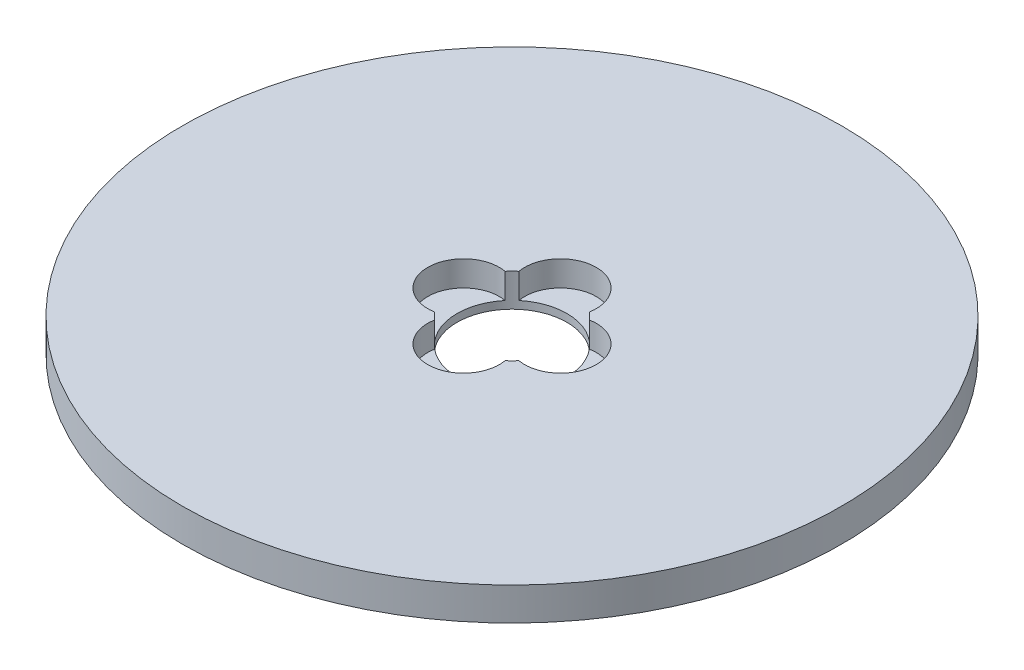
ISO-10303-21;
HEADER;
FILE_DESCRIPTION(('STEP AP214'),'2;1');
FILE_NAME('part.step','',(''),(''),'','','');
FILE_SCHEMA(('AUTOMOTIVE_DESIGN { 1 0 10303 214 1 1 1 1 }'));
ENDSEC;
DATA;
#1=APPLICATION_CONTEXT('core data for automotive mechanical design processes');
#2=APPLICATION_PROTOCOL_DEFINITION('international standard','automotive_design',2000,#1);
#3=PRODUCT_CONTEXT('',#1,'mechanical');
#4=PRODUCT('Part','Part','',(#3));
#5=PRODUCT_RELATED_PRODUCT_CATEGORY('part','',(#4));
#6=PRODUCT_DEFINITION_FORMATION('','',#4);
#7=PRODUCT_DEFINITION_CONTEXT('part definition',#1,'design');
#8=PRODUCT_DEFINITION('design','',#6,#7);
#9=PRODUCT_DEFINITION_SHAPE('','',#8);
#10=(LENGTH_UNIT() NAMED_UNIT(*) SI_UNIT(.MILLI.,.METRE.));
#11=(NAMED_UNIT(*) PLANE_ANGLE_UNIT() SI_UNIT($,.RADIAN.));
#12=(NAMED_UNIT(*) SI_UNIT($,.STERADIAN.) SOLID_ANGLE_UNIT());
#13=UNCERTAINTY_MEASURE_WITH_UNIT(LENGTH_MEASURE(1.E-05),#10,'distance_accuracy_value','');
#14=(GEOMETRIC_REPRESENTATION_CONTEXT(3) GLOBAL_UNCERTAINTY_ASSIGNED_CONTEXT((#13)) GLOBAL_UNIT_ASSIGNED_CONTEXT((#10,
#11,#12)) REPRESENTATION_CONTEXT('',''));
#15=CARTESIAN_POINT('',(0.,0.,0.));
#16=DIRECTION('',(0.,0.,1.));
#17=DIRECTION('',(1.,0.,0.));
#18=AXIS2_PLACEMENT_3D('',#15,#16,#17);
#19=CARTESIAN_POINT('',(0.,9.,0.));
#20=DIRECTION('',(0.,-1.,0.));
#21=DIRECTION('',(0.,0.,-1.));
#22=AXIS2_PLACEMENT_3D('',#19,#20,#21);
#23=CYLINDRICAL_SURFACE('',#22,90.);
#24=CARTESIAN_POINT('',(0.,9.,0.));
#25=DIRECTION('',(0.,1.,0.));
#26=DIRECTION('',(0.,0.,1.));
#27=AXIS2_PLACEMENT_3D('',#24,#25,#26);
#28=CIRCLE('',#27,90.);
#29=CARTESIAN_POINT('',(0.,9.,90.));
#30=VERTEX_POINT('',#29);
#31=EDGE_CURVE('E162',#30,#30,#28,.T.);
#32=ORIENTED_EDGE('',*,*,#31,.F.);
#33=EDGE_LOOP('',(#32));
#34=FACE_BOUND('',#33,.T.);
#35=CARTESIAN_POINT('',(0.,0.,0.));
#36=DIRECTION('',(0.,1.,0.));
#37=DIRECTION('',(0.,0.,1.));
#38=AXIS2_PLACEMENT_3D('',#35,#36,#37);
#39=CIRCLE('',#38,90.);
#40=CARTESIAN_POINT('',(0.,0.,90.));
#41=VERTEX_POINT('',#40);
#42=EDGE_CURVE('E158',#41,#41,#39,.T.);
#43=ORIENTED_EDGE('',*,*,#42,.T.);
#44=EDGE_LOOP('',(#43));
#45=FACE_BOUND('',#44,.T.);
#46=ADVANCED_FACE('F39',(#34,#45),#23,.T.);
#47=CARTESIAN_POINT('',(0.,9.,0.));
#48=DIRECTION('',(0.,1.,0.));
#49=DIRECTION('',(0.,0.,1.));
#50=AXIS2_PLACEMENT_3D('',#47,#48,#49);
#51=PLANE('',#50);
#52=CARTESIAN_POINT('',(0.,9.,13.2310116069244));
#53=DIRECTION('',(0.,1.,0.));
#54=DIRECTION('',(1.,0.,0.));
#55=AXIS2_PLACEMENT_3D('',#52,#53,#54);
#56=CIRCLE('',#55,9.7809804124525);
#57=CARTESIAN_POINT('',(-9.62712211526905,9.,11.5029787349928));
#58=VERTEX_POINT('',#57);
#59=CARTESIAN_POINT('',(9.62712211526913,9.,11.5029787349928));
#60=VERTEX_POINT('',#59);
#61=EDGE_CURVE('E141',#58,#60,#56,.T.);
#62=ORIENTED_EDGE('',*,*,#61,.F.);
#63=CARTESIAN_POINT('',(0.,9.,0.));
#64=DIRECTION('',(0.,1.,0.));
#65=DIRECTION('',(0.,0.,1.));
#66=AXIS2_PLACEMENT_3D('',#63,#64,#65);
#67=CIRCLE('',#66,15.);
#68=CARTESIAN_POINT('',(-11.5029787349928,9.,9.62712211526909));
#69=VERTEX_POINT('',#68);
#70=EDGE_CURVE('E154',#69,#58,#67,.T.);
#71=ORIENTED_EDGE('',*,*,#70,.F.);
#72=CARTESIAN_POINT('',(-13.2310116069244,9.,0.));
#73=DIRECTION('',(0.,1.,0.));
#74=DIRECTION('',(0.,0.,1.));
#75=AXIS2_PLACEMENT_3D('',#72,#73,#74);
#76=CIRCLE('',#75,9.7809804124525);
#77=CARTESIAN_POINT('',(-11.5029787349928,9.,-9.62712211526909));
#78=VERTEX_POINT('',#77);
#79=EDGE_CURVE('E149',#78,#69,#76,.T.);
#80=ORIENTED_EDGE('',*,*,#79,.F.);
#81=CARTESIAN_POINT('',(-9.62712211526921,9.,-11.5029787349927));
#82=VERTEX_POINT('',#81);
#83=EDGE_CURVE('E159',#82,#78,#67,.T.);
#84=ORIENTED_EDGE('',*,*,#83,.F.);
#85=CARTESIAN_POINT('',(-1.3858749035878E-13,9.,-13.2310116069244));
#86=DIRECTION('',(0.,1.,0.));
#87=DIRECTION('',(-1.,0.,0.));
#88=AXIS2_PLACEMENT_3D('',#85,#86,#87);
#89=CIRCLE('',#88,9.7809804124525);
#90=CARTESIAN_POINT('',(9.62712211526897,9.,-11.5029787349929));
#91=VERTEX_POINT('',#90);
#92=EDGE_CURVE('E58',#91,#82,#89,.T.);
#93=ORIENTED_EDGE('',*,*,#92,.F.);
#94=CARTESIAN_POINT('',(11.5029787349928,9.,-9.62712211526909));
#95=VERTEX_POINT('',#94);
#96=EDGE_CURVE('E125',#95,#91,#67,.T.);
#97=ORIENTED_EDGE('',*,*,#96,.F.);
#98=CARTESIAN_POINT('',(13.2310116069244,9.,0.));
#99=DIRECTION('',(0.,1.,0.));
#100=DIRECTION('',(0.,0.,-1.));
#101=AXIS2_PLACEMENT_3D('',#98,#99,#100);
#102=CIRCLE('',#101,9.7809804124525);
#103=CARTESIAN_POINT('',(11.5029787349928,9.,9.62712211526909));
#104=VERTEX_POINT('',#103);
#105=EDGE_CURVE('E111',#104,#95,#102,.T.);
#106=ORIENTED_EDGE('',*,*,#105,.F.);
#107=EDGE_CURVE('E157',#60,#104,#67,.T.);
#108=ORIENTED_EDGE('',*,*,#107,.F.);
#109=EDGE_LOOP('',(#62,#71,#80,#84,#93,#97,#106,#108));
#110=FACE_BOUND('',#109,.T.);
#111=ORIENTED_EDGE('',*,*,#31,.T.);
#112=EDGE_LOOP('',(#111));
#113=FACE_BOUND('',#112,.T.);
#114=ADVANCED_FACE('F186',(#110,#113),#51,.T.);
#115=CARTESIAN_POINT('',(0.,0.,0.));
#116=DIRECTION('',(0.,1.,0.));
#117=DIRECTION('',(0.,0.,1.));
#118=AXIS2_PLACEMENT_3D('',#115,#116,#117);
#119=PLANE('',#118);
#120=CARTESIAN_POINT('',(0.,0.,0.));
#121=DIRECTION('',(0.,1.,0.));
#122=DIRECTION('',(0.,0.,1.));
#123=AXIS2_PLACEMENT_3D('',#120,#121,#122);
#124=CIRCLE('',#123,15.);
#125=CARTESIAN_POINT('',(0.,0.,15.));
#126=VERTEX_POINT('',#125);
#127=EDGE_CURVE('E153',#126,#126,#124,.T.);
#128=ORIENTED_EDGE('',*,*,#127,.T.);
#129=EDGE_LOOP('',(#128));
#130=FACE_BOUND('',#129,.T.);
#131=ORIENTED_EDGE('',*,*,#42,.F.);
#132=EDGE_LOOP('',(#131));
#133=FACE_BOUND('',#132,.T.);
#134=ADVANCED_FACE('F206',(#130,#133),#119,.F.);
#135=CARTESIAN_POINT('',(0.,9.,0.));
#136=DIRECTION('',(0.,-1.,0.));
#137=DIRECTION('',(0.,0.,-1.));
#138=AXIS2_PLACEMENT_3D('',#135,#136,#137);
#139=CYLINDRICAL_SURFACE('',#138,15.);
#140=DIRECTION('',(0.,1.,0.));
#141=VECTOR('',#140,1.);
#142=CARTESIAN_POINT('',(-9.62712211526905,5.54698514774946,11.5029787349928));
#143=LINE('',#142,#141);
#144=CARTESIAN_POINT('',(-9.62712211526905,2.09397029549891,11.5029787349928));
#145=VERTEX_POINT('',#144);
#146=EDGE_CURVE('E11',#145,#58,#143,.T.);
#147=ORIENTED_EDGE('',*,*,#146,.F.);
#148=CARTESIAN_POINT('',(0.,2.09397029549891,0.));
#149=DIRECTION('',(0.,1.,0.));
#150=DIRECTION('',(0.,0.,1.));
#151=AXIS2_PLACEMENT_3D('',#148,#149,#150);
#152=CIRCLE('',#151,15.);
#153=CARTESIAN_POINT('',(9.62712211526913,2.09397029549891,11.5029787349928));
#154=VERTEX_POINT('',#153);
#155=EDGE_CURVE('E112',#145,#154,#152,.T.);
#156=ORIENTED_EDGE('',*,*,#155,.T.);
#157=DIRECTION('',(0.,1.,0.));
#158=VECTOR('',#157,1.);
#159=CARTESIAN_POINT('',(9.62712211526913,5.54698514774946,11.5029787349928));
#160=LINE('',#159,#158);
#161=EDGE_CURVE('E46',#60,#154,#160,.F.);
#162=ORIENTED_EDGE('',*,*,#161,.F.);
#163=ORIENTED_EDGE('',*,*,#107,.T.);
#164=DIRECTION('',(0.,1.,0.));
#165=VECTOR('',#164,1.);
#166=CARTESIAN_POINT('',(11.5029787349928,5.54698514774946,9.62712211526909));
#167=LINE('',#166,#165);
#168=CARTESIAN_POINT('',(11.5029787349928,2.09397029549891,9.62712211526909));
#169=VERTEX_POINT('',#168);
#170=EDGE_CURVE('E126',#169,#104,#167,.T.);
#171=ORIENTED_EDGE('',*,*,#170,.F.);
#172=CARTESIAN_POINT('',(11.5029787349928,2.09397029549891,-9.62712211526909));
#173=VERTEX_POINT('',#172);
#174=EDGE_CURVE('E115',#169,#173,#152,.T.);
#175=ORIENTED_EDGE('',*,*,#174,.T.);
#176=DIRECTION('',(0.,1.,0.));
#177=VECTOR('',#176,1.);
#178=CARTESIAN_POINT('',(11.5029787349928,5.54698514774946,-9.62712211526909));
#179=LINE('',#178,#177);
#180=EDGE_CURVE('E122',#95,#173,#179,.F.);
#181=ORIENTED_EDGE('',*,*,#180,.F.);
#182=ORIENTED_EDGE('',*,*,#96,.T.);
#183=DIRECTION('',(0.,1.,0.));
#184=VECTOR('',#183,1.);
#185=CARTESIAN_POINT('',(9.62712211526897,5.54698514774946,-11.5029787349929));
#186=LINE('',#185,#184);
#187=CARTESIAN_POINT('',(9.62712211526897,2.09397029549891,-11.5029787349929));
#188=VERTEX_POINT('',#187);
#189=EDGE_CURVE('E107',#188,#91,#186,.T.);
#190=ORIENTED_EDGE('',*,*,#189,.F.);
#191=CARTESIAN_POINT('',(-9.62712211526921,2.09397029549891,-11.5029787349927));
#192=VERTEX_POINT('',#191);
#193=EDGE_CURVE('E105',#188,#192,#152,.T.);
#194=ORIENTED_EDGE('',*,*,#193,.T.);
#195=DIRECTION('',(0.,1.,0.));
#196=VECTOR('',#195,1.);
#197=CARTESIAN_POINT('',(-9.62712211526921,5.54698514774946,-11.5029787349927));
#198=LINE('',#197,#196);
#199=EDGE_CURVE('E108',#82,#192,#198,.F.);
#200=ORIENTED_EDGE('',*,*,#199,.F.);
#201=ORIENTED_EDGE('',*,*,#83,.T.);
#202=DIRECTION('',(0.,1.,0.));
#203=VECTOR('',#202,1.);
#204=CARTESIAN_POINT('',(-11.5029787349928,5.54698514774946,-9.62712211526909));
#205=LINE('',#204,#203);
#206=CARTESIAN_POINT('',(-11.5029787349928,2.09397029549891,-9.62712211526909));
#207=VERTEX_POINT('',#206);
#208=EDGE_CURVE('E173',#207,#78,#205,.T.);
#209=ORIENTED_EDGE('',*,*,#208,.F.);
#210=CARTESIAN_POINT('',(0.,2.09397029549891,0.));
#211=DIRECTION('',(0.,1.,0.));
#212=DIRECTION('',(0.,0.,1.));
#213=AXIS2_PLACEMENT_3D('',#210,#211,#212);
#214=CIRCLE('',#213,15.);
#215=CARTESIAN_POINT('',(-11.5029787349928,2.09397029549891,9.62712211526909));
#216=VERTEX_POINT('',#215);
#217=EDGE_CURVE('E167',#207,#216,#214,.T.);
#218=ORIENTED_EDGE('',*,*,#217,.T.);
#219=DIRECTION('',(0.,1.,0.));
#220=VECTOR('',#219,1.);
#221=CARTESIAN_POINT('',(-11.5029787349928,5.54698514774946,9.62712211526909));
#222=LINE('',#221,#220);
#223=EDGE_CURVE('E171',#69,#216,#222,.F.);
#224=ORIENTED_EDGE('',*,*,#223,.F.);
#225=ORIENTED_EDGE('',*,*,#70,.T.);
#226=EDGE_LOOP('',(#147,#156,#162,#163,#171,#175,#181,#182,#190,#194,#200,#201,#209,#218,#224,#225));
#227=FACE_BOUND('',#226,.T.);
#228=ORIENTED_EDGE('',*,*,#127,.F.);
#229=EDGE_LOOP('',(#228));
#230=FACE_BOUND('',#229,.T.);
#231=ADVANCED_FACE('F117',(#227,#230),#139,.F.);
#232=CARTESIAN_POINT('',(-13.2310116069244,2.09397029549891,0.));
#233=DIRECTION('',(0.,1.,0.));
#234=DIRECTION('',(0.,0.,1.));
#235=AXIS2_PLACEMENT_3D('',#232,#233,#234);
#236=CYLINDRICAL_SURFACE('',#235,9.7809804124525);
#237=ORIENTED_EDGE('',*,*,#208,.T.);
#238=ORIENTED_EDGE('',*,*,#79,.T.);
#239=ORIENTED_EDGE('',*,*,#223,.T.);
#240=CARTESIAN_POINT('',(-13.2310116069244,2.09397029549891,0.));
#241=DIRECTION('',(0.,1.,0.));
#242=DIRECTION('',(0.,0.,1.));
#243=AXIS2_PLACEMENT_3D('',#240,#241,#242);
#244=CIRCLE('',#243,9.7809804124525);
#245=EDGE_CURVE('E151',#207,#216,#244,.T.);
#246=ORIENTED_EDGE('',*,*,#245,.F.);
#247=EDGE_LOOP('',(#237,#238,#239,#246));
#248=FACE_BOUND('',#247,.T.);
#249=ADVANCED_FACE('F179',(#248),#236,.F.);
#250=CARTESIAN_POINT('',(-13.2310116069244,2.09397029549891,0.));
#251=DIRECTION('',(0.,1.,0.));
#252=DIRECTION('',(0.,0.,1.));
#253=AXIS2_PLACEMENT_3D('',#250,#251,#252);
#254=PLANE('',#253);
#255=ORIENTED_EDGE('',*,*,#245,.T.);
#256=ORIENTED_EDGE('',*,*,#217,.F.);
#257=EDGE_LOOP('',(#255,#256));
#258=FACE_BOUND('',#257,.T.);
#259=ADVANCED_FACE('F189',(#258),#254,.T.);
#260=CARTESIAN_POINT('',(-1.3858749035878E-13,2.09397029549891,-13.2310116069244));
#261=DIRECTION('',(0.,1.,0.));
#262=DIRECTION('',(0.,0.,1.));
#263=AXIS2_PLACEMENT_3D('',#260,#261,#262);
#264=CYLINDRICAL_SURFACE('',#263,9.7809804124525);
#265=ORIENTED_EDGE('',*,*,#189,.T.);
#266=ORIENTED_EDGE('',*,*,#92,.T.);
#267=ORIENTED_EDGE('',*,*,#199,.T.);
#268=CARTESIAN_POINT('',(-1.3858749035878E-13,2.09397029549891,-13.2310116069244));
#269=DIRECTION('',(0.,1.,0.));
#270=DIRECTION('',(-1.,0.,0.));
#271=AXIS2_PLACEMENT_3D('',#268,#269,#270);
#272=CIRCLE('',#271,9.7809804124525);
#273=EDGE_CURVE('E104',#188,#192,#272,.T.);
#274=ORIENTED_EDGE('',*,*,#273,.F.);
#275=EDGE_LOOP('',(#265,#266,#267,#274));
#276=FACE_BOUND('',#275,.T.);
#277=ADVANCED_FACE('F114',(#276),#264,.F.);
#278=CARTESIAN_POINT('',(0.,2.09397029549891,13.2310116069244));
#279=DIRECTION('',(0.,1.,0.));
#280=DIRECTION('',(1.,0.,0.));
#281=AXIS2_PLACEMENT_3D('',#278,#279,#280);
#282=PLANE('',#281);
#283=ORIENTED_EDGE('',*,*,#273,.T.);
#284=ORIENTED_EDGE('',*,*,#193,.F.);
#285=EDGE_LOOP('',(#283,#284));
#286=FACE_BOUND('',#285,.T.);
#287=ADVANCED_FACE('F102',(#286),#282,.T.);
#288=CARTESIAN_POINT('',(13.2310116069244,2.09397029549891,0.));
#289=DIRECTION('',(0.,1.,0.));
#290=DIRECTION('',(0.,0.,1.));
#291=AXIS2_PLACEMENT_3D('',#288,#289,#290);
#292=CYLINDRICAL_SURFACE('',#291,9.7809804124525);
#293=ORIENTED_EDGE('',*,*,#170,.T.);
#294=ORIENTED_EDGE('',*,*,#105,.T.);
#295=ORIENTED_EDGE('',*,*,#180,.T.);
#296=CARTESIAN_POINT('',(13.2310116069244,2.09397029549891,0.));
#297=DIRECTION('',(0.,1.,0.));
#298=DIRECTION('',(0.,0.,-1.));
#299=AXIS2_PLACEMENT_3D('',#296,#297,#298);
#300=CIRCLE('',#299,9.7809804124525);
#301=EDGE_CURVE('E138',#169,#173,#300,.T.);
#302=ORIENTED_EDGE('',*,*,#301,.F.);
#303=EDGE_LOOP('',(#293,#294,#295,#302));
#304=FACE_BOUND('',#303,.T.);
#305=ADVANCED_FACE('F143',(#304),#292,.F.);
#306=ORIENTED_EDGE('',*,*,#301,.T.);
#307=ORIENTED_EDGE('',*,*,#174,.F.);
#308=EDGE_LOOP('',(#306,#307));
#309=FACE_BOUND('',#308,.T.);
#310=ADVANCED_FACE('F137',(#309),#282,.T.);
#311=CARTESIAN_POINT('',(0.,2.09397029549891,13.2310116069244));
#312=DIRECTION('',(0.,1.,0.));
#313=DIRECTION('',(0.,0.,1.));
#314=AXIS2_PLACEMENT_3D('',#311,#312,#313);
#315=CYLINDRICAL_SURFACE('',#314,9.7809804124525);
#316=ORIENTED_EDGE('',*,*,#146,.T.);
#317=ORIENTED_EDGE('',*,*,#61,.T.);
#318=ORIENTED_EDGE('',*,*,#161,.T.);
#319=CARTESIAN_POINT('',(0.,2.09397029549891,13.2310116069244));
#320=DIRECTION('',(0.,1.,0.));
#321=DIRECTION('',(1.,0.,0.));
#322=AXIS2_PLACEMENT_3D('',#319,#320,#321);
#323=CIRCLE('',#322,9.7809804124525);
#324=EDGE_CURVE('E55',#145,#154,#323,.T.);
#325=ORIENTED_EDGE('',*,*,#324,.F.);
#326=EDGE_LOOP('',(#316,#317,#318,#325));
#327=FACE_BOUND('',#326,.T.);
#328=ADVANCED_FACE('F252',(#327),#315,.F.);
#329=ORIENTED_EDGE('',*,*,#324,.T.);
#330=ORIENTED_EDGE('',*,*,#155,.F.);
#331=EDGE_LOOP('',(#329,#330));
#332=FACE_BOUND('',#331,.T.);
#333=ADVANCED_FACE('F240',(#332),#282,.T.);
#334=CLOSED_SHELL('',(#46,#114,#134,#231,#249,#259,#277,#287,#305,#310,#328,#333));
#335=MANIFOLD_SOLID_BREP('B2',#334);
#336=ADVANCED_BREP_SHAPE_REPRESENTATION('',(#18,#335),#14);
#337=SHAPE_DEFINITION_REPRESENTATION(#9,#336);
ENDSEC;
END-ISO-10303-21;
